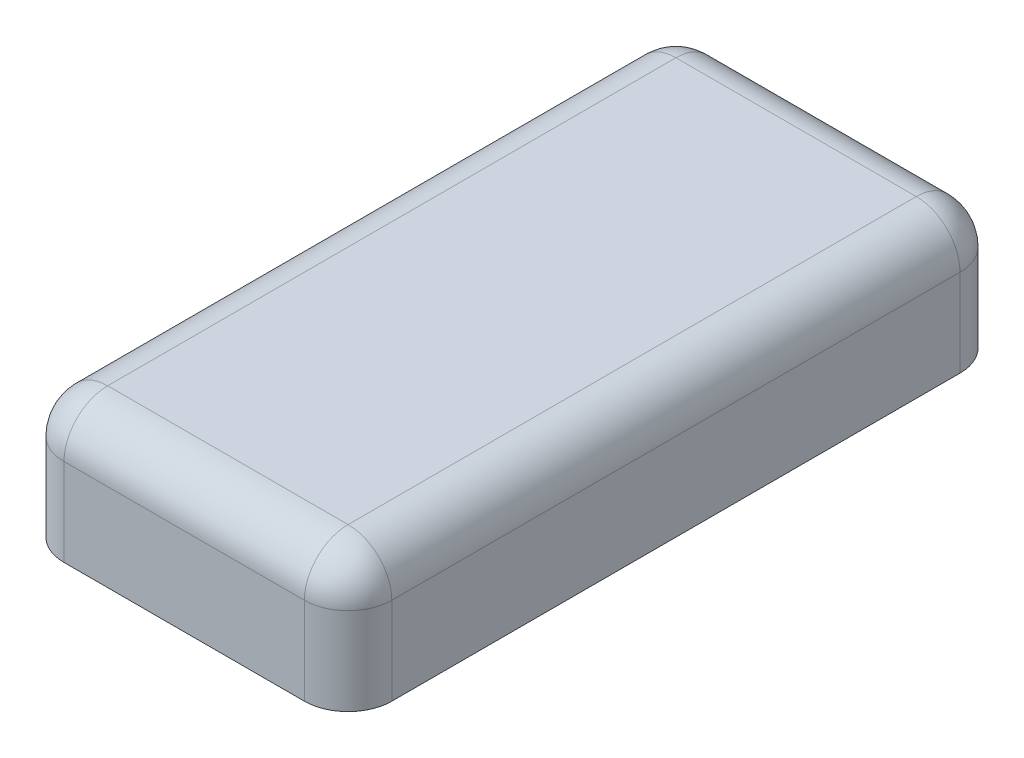
ISO-10303-21;
HEADER;
FILE_DESCRIPTION(('STEP AP214'),'2;1');
FILE_NAME('part.step','',(''),(''),'','','');
FILE_SCHEMA(('AUTOMOTIVE_DESIGN { 1 0 10303 214 1 1 1 1 }'));
ENDSEC;
DATA;
#1=APPLICATION_CONTEXT('core data for automotive mechanical design processes');
#2=APPLICATION_PROTOCOL_DEFINITION('international standard','automotive_design',2000,#1);
#3=PRODUCT_CONTEXT('',#1,'mechanical');
#4=PRODUCT('Part','Part','',(#3));
#5=PRODUCT_RELATED_PRODUCT_CATEGORY('part','',(#4));
#6=PRODUCT_DEFINITION_FORMATION('','',#4);
#7=PRODUCT_DEFINITION_CONTEXT('part definition',#1,'design');
#8=PRODUCT_DEFINITION('design','',#6,#7);
#9=PRODUCT_DEFINITION_SHAPE('','',#8);
#10=(LENGTH_UNIT() NAMED_UNIT(*) SI_UNIT(.MILLI.,.METRE.));
#11=(NAMED_UNIT(*) PLANE_ANGLE_UNIT() SI_UNIT($,.RADIAN.));
#12=(NAMED_UNIT(*) SI_UNIT($,.STERADIAN.) SOLID_ANGLE_UNIT());
#13=UNCERTAINTY_MEASURE_WITH_UNIT(LENGTH_MEASURE(1.E-05),#10,'distance_accuracy_value','');
#14=(GEOMETRIC_REPRESENTATION_CONTEXT(3) GLOBAL_UNCERTAINTY_ASSIGNED_CONTEXT((#13)) GLOBAL_UNIT_ASSIGNED_CONTEXT((#10,
#11,#12)) REPRESENTATION_CONTEXT('',''));
#15=CARTESIAN_POINT('',(0.,0.,0.));
#16=DIRECTION('',(0.,0.,1.));
#17=DIRECTION('',(1.,0.,0.));
#18=AXIS2_PLACEMENT_3D('',#15,#16,#17);
#19=CARTESIAN_POINT('',(0.75,0.6,-1.5));
#20=DIRECTION('',(-1.,0.,0.));
#21=DIRECTION('',(0.,0.,1.));
#22=AXIS2_PLACEMENT_3D('',#19,#20,#21);
#23=PLANE('',#22);
#24=DIRECTION('',(0.,-1.,0.));
#25=VECTOR('',#24,1.);
#26=CARTESIAN_POINT('',(0.75,0.6,-1.3));
#27=LINE('',#26,#25);
#28=CARTESIAN_POINT('',(0.75,0.,-1.3));
#29=VERTEX_POINT('',#28);
#30=CARTESIAN_POINT('',(0.75,0.4,-1.3));
#31=VERTEX_POINT('',#30);
#32=EDGE_CURVE('E121',#29,#31,#27,.F.);
#33=ORIENTED_EDGE('',*,*,#32,.T.);
#34=DIRECTION('',(0.,0.,-1.));
#35=VECTOR('',#34,1.);
#36=CARTESIAN_POINT('',(0.75,0.4,1.3));
#37=LINE('',#36,#35);
#38=CARTESIAN_POINT('',(0.75,0.4,1.3));
#39=VERTEX_POINT('',#38);
#40=EDGE_CURVE('E61',#31,#39,#37,.F.);
#41=ORIENTED_EDGE('',*,*,#40,.T.);
#42=DIRECTION('',(0.,-1.,0.));
#43=VECTOR('',#42,1.);
#44=CARTESIAN_POINT('',(0.75,0.6,1.3));
#45=LINE('',#44,#43);
#46=CARTESIAN_POINT('',(0.75,0.,1.3));
#47=VERTEX_POINT('',#46);
#48=EDGE_CURVE('E114',#39,#47,#45,.T.);
#49=ORIENTED_EDGE('',*,*,#48,.T.);
#50=DIRECTION('',(0.,0.,-1.));
#51=VECTOR('',#50,1.);
#52=CARTESIAN_POINT('',(0.75,0.,-1.5));
#53=LINE('',#52,#51);
#54=EDGE_CURVE('E117',#47,#29,#53,.T.);
#55=ORIENTED_EDGE('',*,*,#54,.T.);
#56=EDGE_LOOP('',(#33,#41,#49,#55));
#57=FACE_BOUND('',#56,.T.);
#58=ADVANCED_FACE('F37',(#57),#23,.F.);
#59=CARTESIAN_POINT('',(-0.75,0.6,-1.5));
#60=DIRECTION('',(0.,0.,1.));
#61=DIRECTION('',(1.,0.,0.));
#62=AXIS2_PLACEMENT_3D('',#59,#60,#61);
#63=PLANE('',#62);
#64=DIRECTION('',(0.,-1.,0.));
#65=VECTOR('',#64,1.);
#66=CARTESIAN_POINT('',(-0.55,0.6,-1.5));
#67=LINE('',#66,#65);
#68=CARTESIAN_POINT('',(-0.55,0.,-1.5));
#69=VERTEX_POINT('',#68);
#70=CARTESIAN_POINT('',(-0.55,0.4,-1.5));
#71=VERTEX_POINT('',#70);
#72=EDGE_CURVE('E154',#69,#71,#67,.F.);
#73=ORIENTED_EDGE('',*,*,#72,.T.);
#74=DIRECTION('',(-1.,0.,0.));
#75=VECTOR('',#74,1.);
#76=CARTESIAN_POINT('',(0.55,0.4,-1.5));
#77=LINE('',#76,#75);
#78=CARTESIAN_POINT('',(0.55,0.4,-1.5));
#79=VERTEX_POINT('',#78);
#80=EDGE_CURVE('E180',#71,#79,#77,.F.);
#81=ORIENTED_EDGE('',*,*,#80,.T.);
#82=DIRECTION('',(0.,-1.,0.));
#83=VECTOR('',#82,1.);
#84=CARTESIAN_POINT('',(0.55,0.6,-1.5));
#85=LINE('',#84,#83);
#86=CARTESIAN_POINT('',(0.55,0.,-1.5));
#87=VERTEX_POINT('',#86);
#88=EDGE_CURVE('E157',#79,#87,#85,.T.);
#89=ORIENTED_EDGE('',*,*,#88,.T.);
#90=DIRECTION('',(-1.,0.,0.));
#91=VECTOR('',#90,1.);
#92=CARTESIAN_POINT('',(-0.75,0.,-1.5));
#93=LINE('',#92,#91);
#94=EDGE_CURVE('E135',#87,#69,#93,.T.);
#95=ORIENTED_EDGE('',*,*,#94,.T.);
#96=EDGE_LOOP('',(#73,#81,#89,#95));
#97=FACE_BOUND('',#96,.T.);
#98=ADVANCED_FACE('F239',(#97),#63,.F.);
#99=CARTESIAN_POINT('',(-0.75,0.6,-1.5));
#100=DIRECTION('',(1.,0.,0.));
#101=DIRECTION('',(0.,0.,-1.));
#102=AXIS2_PLACEMENT_3D('',#99,#100,#101);
#103=PLANE('',#102);
#104=DIRECTION('',(0.,-1.,0.));
#105=VECTOR('',#104,1.);
#106=CARTESIAN_POINT('',(-0.75,0.6,1.3));
#107=LINE('',#106,#105);
#108=CARTESIAN_POINT('',(-0.75,0.,1.3));
#109=VERTEX_POINT('',#108);
#110=CARTESIAN_POINT('',(-0.75,0.4,1.3));
#111=VERTEX_POINT('',#110);
#112=EDGE_CURVE('E161',#109,#111,#107,.F.);
#113=ORIENTED_EDGE('',*,*,#112,.T.);
#114=DIRECTION('',(0.,0.,1.));
#115=VECTOR('',#114,1.);
#116=CARTESIAN_POINT('',(-0.75,0.4,-1.3));
#117=LINE('',#116,#115);
#118=CARTESIAN_POINT('',(-0.75,0.4,-1.3));
#119=VERTEX_POINT('',#118);
#120=EDGE_CURVE('E176',#111,#119,#117,.F.);
#121=ORIENTED_EDGE('',*,*,#120,.T.);
#122=DIRECTION('',(0.,-1.,0.));
#123=VECTOR('',#122,1.);
#124=CARTESIAN_POINT('',(-0.75,0.6,-1.3));
#125=LINE('',#124,#123);
#126=CARTESIAN_POINT('',(-0.75,0.,-1.3));
#127=VERTEX_POINT('',#126);
#128=EDGE_CURVE('E159',#119,#127,#125,.T.);
#129=ORIENTED_EDGE('',*,*,#128,.T.);
#130=DIRECTION('',(0.,0.,1.));
#131=VECTOR('',#130,1.);
#132=CARTESIAN_POINT('',(-0.75,0.,-1.5));
#133=LINE('',#132,#131);
#134=EDGE_CURVE('E138',#127,#109,#133,.T.);
#135=ORIENTED_EDGE('',*,*,#134,.T.);
#136=EDGE_LOOP('',(#113,#121,#129,#135));
#137=FACE_BOUND('',#136,.T.);
#138=ADVANCED_FACE('F244',(#137),#103,.F.);
#139=CARTESIAN_POINT('',(-0.75,0.6,1.5));
#140=DIRECTION('',(0.,0.,-1.));
#141=DIRECTION('',(-1.,0.,0.));
#142=AXIS2_PLACEMENT_3D('',#139,#140,#141);
#143=PLANE('',#142);
#144=DIRECTION('',(0.,-1.,0.));
#145=VECTOR('',#144,1.);
#146=CARTESIAN_POINT('',(0.55,0.6,1.5));
#147=LINE('',#146,#145);
#148=CARTESIAN_POINT('',(0.55,0.,1.5));
#149=VERTEX_POINT('',#148);
#150=CARTESIAN_POINT('',(0.55,0.4,1.5));
#151=VERTEX_POINT('',#150);
#152=EDGE_CURVE('E125',#149,#151,#147,.F.);
#153=ORIENTED_EDGE('',*,*,#152,.T.);
#154=DIRECTION('',(1.,0.,0.));
#155=VECTOR('',#154,1.);
#156=CARTESIAN_POINT('',(-0.55,0.4,1.5));
#157=LINE('',#156,#155);
#158=CARTESIAN_POINT('',(-0.55,0.4,1.5));
#159=VERTEX_POINT('',#158);
#160=EDGE_CURVE('E11',#151,#159,#157,.F.);
#161=ORIENTED_EDGE('',*,*,#160,.T.);
#162=DIRECTION('',(0.,-1.,0.));
#163=VECTOR('',#162,1.);
#164=CARTESIAN_POINT('',(-0.55,0.6,1.5));
#165=LINE('',#164,#163);
#166=CARTESIAN_POINT('',(-0.55,0.,1.5));
#167=VERTEX_POINT('',#166);
#168=EDGE_CURVE('E129',#159,#167,#165,.T.);
#169=ORIENTED_EDGE('',*,*,#168,.T.);
#170=DIRECTION('',(1.,0.,0.));
#171=VECTOR('',#170,1.);
#172=CARTESIAN_POINT('',(-0.75,0.,1.5));
#173=LINE('',#172,#171);
#174=EDGE_CURVE('E145',#167,#149,#173,.T.);
#175=ORIENTED_EDGE('',*,*,#174,.T.);
#176=EDGE_LOOP('',(#153,#161,#169,#175));
#177=FACE_BOUND('',#176,.T.);
#178=ADVANCED_FACE('F355',(#177),#143,.F.);
#179=CARTESIAN_POINT('',(0.,0.6,0.));
#180=DIRECTION('',(0.,1.,0.));
#181=DIRECTION('',(0.,0.,1.));
#182=AXIS2_PLACEMENT_3D('',#179,#180,#181);
#183=PLANE('',#182);
#184=DIRECTION('',(-1.,0.,0.));
#185=VECTOR('',#184,1.);
#186=CARTESIAN_POINT('',(-0.55,0.6,-1.3));
#187=LINE('',#186,#185);
#188=CARTESIAN_POINT('',(0.55,0.6,-1.3));
#189=VERTEX_POINT('',#188);
#190=CARTESIAN_POINT('',(-0.55,0.6,-1.3));
#191=VERTEX_POINT('',#190);
#192=EDGE_CURVE('E171',#189,#191,#187,.T.);
#193=ORIENTED_EDGE('',*,*,#192,.T.);
#194=DIRECTION('',(0.,0.,1.));
#195=VECTOR('',#194,1.);
#196=CARTESIAN_POINT('',(-0.55,0.6,1.3));
#197=LINE('',#196,#195);
#198=CARTESIAN_POINT('',(-0.55,0.6,1.3));
#199=VERTEX_POINT('',#198);
#200=EDGE_CURVE('E173',#191,#199,#197,.T.);
#201=ORIENTED_EDGE('',*,*,#200,.T.);
#202=DIRECTION('',(1.,0.,0.));
#203=VECTOR('',#202,1.);
#204=CARTESIAN_POINT('',(0.55,0.6,1.3));
#205=LINE('',#204,#203);
#206=CARTESIAN_POINT('',(0.55,0.6,1.3));
#207=VERTEX_POINT('',#206);
#208=EDGE_CURVE('E167',#199,#207,#205,.T.);
#209=ORIENTED_EDGE('',*,*,#208,.T.);
#210=DIRECTION('',(0.,0.,-1.));
#211=VECTOR('',#210,1.);
#212=CARTESIAN_POINT('',(0.55,0.6,-1.3));
#213=LINE('',#212,#211);
#214=EDGE_CURVE('E169',#207,#189,#213,.T.);
#215=ORIENTED_EDGE('',*,*,#214,.T.);
#216=EDGE_LOOP('',(#193,#201,#209,#215));
#217=FACE_BOUND('',#216,.T.);
#218=ADVANCED_FACE('F216',(#217),#183,.T.);
#219=CARTESIAN_POINT('',(0.,0.,0.));
#220=DIRECTION('',(0.,1.,0.));
#221=DIRECTION('',(0.,0.,1.));
#222=AXIS2_PLACEMENT_3D('',#219,#220,#221);
#223=PLANE('',#222);
#224=ORIENTED_EDGE('',*,*,#54,.F.);
#225=CARTESIAN_POINT('',(0.55,0.,1.3));
#226=DIRECTION('',(0.,1.,0.));
#227=DIRECTION('',(0.,0.,1.));
#228=AXIS2_PLACEMENT_3D('',#225,#226,#227);
#229=CIRCLE('',#228,0.2);
#230=EDGE_CURVE('E123',#47,#149,#229,.F.);
#231=ORIENTED_EDGE('',*,*,#230,.T.);
#232=ORIENTED_EDGE('',*,*,#174,.F.);
#233=CARTESIAN_POINT('',(-0.55,0.,1.3));
#234=DIRECTION('',(0.,1.,0.));
#235=DIRECTION('',(0.,0.,1.));
#236=AXIS2_PLACEMENT_3D('',#233,#234,#235);
#237=CIRCLE('',#236,0.2);
#238=EDGE_CURVE('E149',#167,#109,#237,.F.);
#239=ORIENTED_EDGE('',*,*,#238,.T.);
#240=ORIENTED_EDGE('',*,*,#134,.F.);
#241=CARTESIAN_POINT('',(-0.55,0.,-1.3));
#242=DIRECTION('',(0.,1.,0.));
#243=DIRECTION('',(0.,0.,1.));
#244=AXIS2_PLACEMENT_3D('',#241,#242,#243);
#245=CIRCLE('',#244,0.2);
#246=EDGE_CURVE('E120',#127,#69,#245,.F.);
#247=ORIENTED_EDGE('',*,*,#246,.T.);
#248=ORIENTED_EDGE('',*,*,#94,.F.);
#249=CARTESIAN_POINT('',(0.55,0.,-1.3));
#250=DIRECTION('',(0.,1.,0.));
#251=DIRECTION('',(0.,0.,1.));
#252=AXIS2_PLACEMENT_3D('',#249,#250,#251);
#253=CIRCLE('',#252,0.2);
#254=EDGE_CURVE('E130',#87,#29,#253,.F.);
#255=ORIENTED_EDGE('',*,*,#254,.T.);
#256=EDGE_LOOP('',(#224,#231,#232,#239,#240,#247,#248,#255));
#257=FACE_BOUND('',#256,.T.);
#258=ADVANCED_FACE('F132',(#257),#223,.F.);
#259=CARTESIAN_POINT('',(0.55,0.6,1.3));
#260=DIRECTION('',(0.,-1.,0.));
#261=DIRECTION('',(0.,0.,-1.));
#262=AXIS2_PLACEMENT_3D('',#259,#260,#261);
#263=CYLINDRICAL_SURFACE('',#262,0.2);
#264=ORIENTED_EDGE('',*,*,#48,.F.);
#265=CARTESIAN_POINT('',(0.55,0.4,1.3));
#266=DIRECTION('',(0.,-1.,0.));
#267=DIRECTION('',(0.,0.,-1.));
#268=AXIS2_PLACEMENT_3D('',#265,#266,#267);
#269=CIRCLE('',#268,0.2);
#270=EDGE_CURVE('E46',#39,#151,#269,.T.);
#271=ORIENTED_EDGE('',*,*,#270,.T.);
#272=ORIENTED_EDGE('',*,*,#152,.F.);
#273=ORIENTED_EDGE('',*,*,#230,.F.);
#274=EDGE_LOOP('',(#264,#271,#272,#273));
#275=FACE_BOUND('',#274,.T.);
#276=ADVANCED_FACE('F124',(#275),#263,.T.);
#277=CARTESIAN_POINT('',(0.55,0.6,-1.3));
#278=DIRECTION('',(0.,-1.,0.));
#279=DIRECTION('',(0.,0.,-1.));
#280=AXIS2_PLACEMENT_3D('',#277,#278,#279);
#281=CYLINDRICAL_SURFACE('',#280,0.2);
#282=ORIENTED_EDGE('',*,*,#88,.F.);
#283=CARTESIAN_POINT('',(0.55,0.4,-1.3));
#284=DIRECTION('',(0.,-1.,0.));
#285=DIRECTION('',(0.,0.,-1.));
#286=AXIS2_PLACEMENT_3D('',#283,#284,#285);
#287=CIRCLE('',#286,0.2);
#288=EDGE_CURVE('E182',#79,#31,#287,.T.);
#289=ORIENTED_EDGE('',*,*,#288,.T.);
#290=ORIENTED_EDGE('',*,*,#32,.F.);
#291=ORIENTED_EDGE('',*,*,#254,.F.);
#292=EDGE_LOOP('',(#282,#289,#290,#291));
#293=FACE_BOUND('',#292,.T.);
#294=ADVANCED_FACE('F251',(#293),#281,.T.);
#295=CARTESIAN_POINT('',(-0.55,0.6,1.3));
#296=DIRECTION('',(0.,-1.,0.));
#297=DIRECTION('',(0.,0.,-1.));
#298=AXIS2_PLACEMENT_3D('',#295,#296,#297);
#299=CYLINDRICAL_SURFACE('',#298,0.2);
#300=ORIENTED_EDGE('',*,*,#168,.F.);
#301=CARTESIAN_POINT('',(-0.55,0.4,1.3));
#302=DIRECTION('',(0.,-1.,0.));
#303=DIRECTION('',(0.,0.,-1.));
#304=AXIS2_PLACEMENT_3D('',#301,#302,#303);
#305=CIRCLE('',#304,0.2);
#306=EDGE_CURVE('E164',#159,#111,#305,.T.);
#307=ORIENTED_EDGE('',*,*,#306,.T.);
#308=ORIENTED_EDGE('',*,*,#112,.F.);
#309=ORIENTED_EDGE('',*,*,#238,.F.);
#310=EDGE_LOOP('',(#300,#307,#308,#309));
#311=FACE_BOUND('',#310,.T.);
#312=ADVANCED_FACE('F254',(#311),#299,.T.);
#313=CARTESIAN_POINT('',(-0.55,0.6,-1.3));
#314=DIRECTION('',(0.,-1.,0.));
#315=DIRECTION('',(0.,0.,-1.));
#316=AXIS2_PLACEMENT_3D('',#313,#314,#315);
#317=CYLINDRICAL_SURFACE('',#316,0.2);
#318=ORIENTED_EDGE('',*,*,#128,.F.);
#319=CARTESIAN_POINT('',(-0.55,0.4,-1.3));
#320=DIRECTION('',(0.,-1.,0.));
#321=DIRECTION('',(0.,0.,-1.));
#322=AXIS2_PLACEMENT_3D('',#319,#320,#321);
#323=CIRCLE('',#322,0.2);
#324=EDGE_CURVE('E178',#119,#71,#323,.T.);
#325=ORIENTED_EDGE('',*,*,#324,.T.);
#326=ORIENTED_EDGE('',*,*,#72,.F.);
#327=ORIENTED_EDGE('',*,*,#246,.F.);
#328=EDGE_LOOP('',(#318,#325,#326,#327));
#329=FACE_BOUND('',#328,.T.);
#330=ADVANCED_FACE('F258',(#329),#317,.T.);
#331=CARTESIAN_POINT('',(0.55,0.4,-1.3));
#332=DIRECTION('',(0.,1.,0.));
#333=DIRECTION('',(0.,0.,1.));
#334=AXIS2_PLACEMENT_3D('',#331,#332,#333);
#335=SPHERICAL_SURFACE('',#334,0.2);
#336=CARTESIAN_POINT('',(0.55,0.4,-1.3));
#337=DIRECTION('',(0.,0.,1.));
#338=DIRECTION('',(1.,0.,0.));
#339=AXIS2_PLACEMENT_3D('',#336,#337,#338);
#340=CIRCLE('',#339,0.2);
#341=EDGE_CURVE('E141',#31,#189,#340,.T.);
#342=ORIENTED_EDGE('',*,*,#341,.F.);
#343=ORIENTED_EDGE('',*,*,#288,.F.);
#344=CARTESIAN_POINT('',(0.55,0.4,-1.3));
#345=DIRECTION('',(-1.,0.,0.));
#346=DIRECTION('',(0.,0.,1.));
#347=AXIS2_PLACEMENT_3D('',#344,#345,#346);
#348=CIRCLE('',#347,0.2);
#349=EDGE_CURVE('E41',#189,#79,#348,.T.);
#350=ORIENTED_EDGE('',*,*,#349,.F.);
#351=EDGE_LOOP('',(#342,#343,#350));
#352=FACE_BOUND('',#351,.T.);
#353=ADVANCED_FACE('F39',(#352),#335,.T.);
#354=CARTESIAN_POINT('',(0.,0.4,-1.3));
#355=DIRECTION('',(1.,0.,0.));
#356=DIRECTION('',(0.,0.,-1.));
#357=AXIS2_PLACEMENT_3D('',#354,#355,#356);
#358=CYLINDRICAL_SURFACE('',#357,0.2);
#359=ORIENTED_EDGE('',*,*,#349,.T.);
#360=ORIENTED_EDGE('',*,*,#80,.F.);
#361=CARTESIAN_POINT('',(-0.55,0.4,-1.3));
#362=DIRECTION('',(-1.,0.,0.));
#363=DIRECTION('',(0.,0.,1.));
#364=AXIS2_PLACEMENT_3D('',#361,#362,#363);
#365=CIRCLE('',#364,0.2);
#366=EDGE_CURVE('E199',#191,#71,#365,.T.);
#367=ORIENTED_EDGE('',*,*,#366,.F.);
#368=ORIENTED_EDGE('',*,*,#192,.F.);
#369=EDGE_LOOP('',(#359,#360,#367,#368));
#370=FACE_BOUND('',#369,.T.);
#371=ADVANCED_FACE('F213',(#370),#358,.T.);
#372=CARTESIAN_POINT('',(0.55,0.4,0.));
#373=DIRECTION('',(0.,0.,1.));
#374=DIRECTION('',(1.,0.,0.));
#375=AXIS2_PLACEMENT_3D('',#372,#373,#374);
#376=CYLINDRICAL_SURFACE('',#375,0.2);
#377=ORIENTED_EDGE('',*,*,#341,.T.);
#378=ORIENTED_EDGE('',*,*,#214,.F.);
#379=CARTESIAN_POINT('',(0.55,0.4,1.3));
#380=DIRECTION('',(0.,0.,1.));
#381=DIRECTION('',(1.,0.,0.));
#382=AXIS2_PLACEMENT_3D('',#379,#380,#381);
#383=CIRCLE('',#382,0.2);
#384=EDGE_CURVE('E196',#39,#207,#383,.T.);
#385=ORIENTED_EDGE('',*,*,#384,.F.);
#386=ORIENTED_EDGE('',*,*,#40,.F.);
#387=EDGE_LOOP('',(#377,#378,#385,#386));
#388=FACE_BOUND('',#387,.T.);
#389=ADVANCED_FACE('F206',(#388),#376,.T.);
#390=CARTESIAN_POINT('',(-0.55,0.4,-1.3));
#391=DIRECTION('',(0.,1.,0.));
#392=DIRECTION('',(0.,0.,1.));
#393=AXIS2_PLACEMENT_3D('',#390,#391,#392);
#394=SPHERICAL_SURFACE('',#393,0.2);
#395=ORIENTED_EDGE('',*,*,#366,.T.);
#396=ORIENTED_EDGE('',*,*,#324,.F.);
#397=CARTESIAN_POINT('',(-0.55,0.4,-1.3));
#398=DIRECTION('',(0.,0.,1.));
#399=DIRECTION('',(1.,0.,0.));
#400=AXIS2_PLACEMENT_3D('',#397,#398,#399);
#401=CIRCLE('',#400,0.2);
#402=EDGE_CURVE('E193',#191,#119,#401,.T.);
#403=ORIENTED_EDGE('',*,*,#402,.F.);
#404=EDGE_LOOP('',(#395,#396,#403));
#405=FACE_BOUND('',#404,.T.);
#406=ADVANCED_FACE('F228',(#405),#394,.T.);
#407=CARTESIAN_POINT('',(0.55,0.4,1.3));
#408=DIRECTION('',(0.,1.,0.));
#409=DIRECTION('',(0.,0.,1.));
#410=AXIS2_PLACEMENT_3D('',#407,#408,#409);
#411=SPHERICAL_SURFACE('',#410,0.2);
#412=ORIENTED_EDGE('',*,*,#270,.F.);
#413=ORIENTED_EDGE('',*,*,#384,.T.);
#414=CARTESIAN_POINT('',(0.55,0.4,1.3));
#415=DIRECTION('',(-1.,0.,0.));
#416=DIRECTION('',(0.,0.,1.));
#417=AXIS2_PLACEMENT_3D('',#414,#415,#416);
#418=CIRCLE('',#417,0.2);
#419=EDGE_CURVE('E190',#151,#207,#418,.T.);
#420=ORIENTED_EDGE('',*,*,#419,.F.);
#421=EDGE_LOOP('',(#412,#413,#420));
#422=FACE_BOUND('',#421,.T.);
#423=ADVANCED_FACE('F225',(#422),#411,.T.);
#424=CARTESIAN_POINT('',(-0.55,0.4,0.));
#425=DIRECTION('',(0.,0.,-1.));
#426=DIRECTION('',(-1.,0.,0.));
#427=AXIS2_PLACEMENT_3D('',#424,#425,#426);
#428=CYLINDRICAL_SURFACE('',#427,0.2);
#429=ORIENTED_EDGE('',*,*,#402,.T.);
#430=ORIENTED_EDGE('',*,*,#120,.F.);
#431=CARTESIAN_POINT('',(-0.55,0.4,1.3));
#432=DIRECTION('',(0.,0.,1.));
#433=DIRECTION('',(1.,0.,0.));
#434=AXIS2_PLACEMENT_3D('',#431,#432,#433);
#435=CIRCLE('',#434,0.2);
#436=EDGE_CURVE('E188',#199,#111,#435,.T.);
#437=ORIENTED_EDGE('',*,*,#436,.F.);
#438=ORIENTED_EDGE('',*,*,#200,.F.);
#439=EDGE_LOOP('',(#429,#430,#437,#438));
#440=FACE_BOUND('',#439,.T.);
#441=ADVANCED_FACE('F227',(#440),#428,.T.);
#442=CARTESIAN_POINT('',(0.,0.4,1.3));
#443=DIRECTION('',(-1.,0.,0.));
#444=DIRECTION('',(0.,0.,1.));
#445=AXIS2_PLACEMENT_3D('',#442,#443,#444);
#446=CYLINDRICAL_SURFACE('',#445,0.2);
#447=ORIENTED_EDGE('',*,*,#419,.T.);
#448=ORIENTED_EDGE('',*,*,#208,.F.);
#449=CARTESIAN_POINT('',(-0.55,0.4,1.3));
#450=DIRECTION('',(-1.,0.,0.));
#451=DIRECTION('',(0.,0.,1.));
#452=AXIS2_PLACEMENT_3D('',#449,#450,#451);
#453=CIRCLE('',#452,0.2);
#454=EDGE_CURVE('E186',#159,#199,#453,.T.);
#455=ORIENTED_EDGE('',*,*,#454,.F.);
#456=ORIENTED_EDGE('',*,*,#160,.F.);
#457=EDGE_LOOP('',(#447,#448,#455,#456));
#458=FACE_BOUND('',#457,.T.);
#459=ADVANCED_FACE('F221',(#458),#446,.T.);
#460=CARTESIAN_POINT('',(-0.55,0.4,1.3));
#461=DIRECTION('',(0.,1.,0.));
#462=DIRECTION('',(0.,0.,1.));
#463=AXIS2_PLACEMENT_3D('',#460,#461,#462);
#464=SPHERICAL_SURFACE('',#463,0.2);
#465=ORIENTED_EDGE('',*,*,#436,.T.);
#466=ORIENTED_EDGE('',*,*,#306,.F.);
#467=ORIENTED_EDGE('',*,*,#454,.T.);
#468=EDGE_LOOP('',(#465,#466,#467));
#469=FACE_BOUND('',#468,.T.);
#470=ADVANCED_FACE('F263',(#469),#464,.T.);
#471=CLOSED_SHELL('',(#58,#98,#138,#178,#218,#258,#276,#294,#312,#330,#353,#371,#389,#406,#423,
#441,#459,#470));
#472=MANIFOLD_SOLID_BREP('B2',#471);
#473=ADVANCED_BREP_SHAPE_REPRESENTATION('',(#18,#472),#14);
#474=SHAPE_DEFINITION_REPRESENTATION(#9,#473);
ENDSEC;
END-ISO-10303-21;
